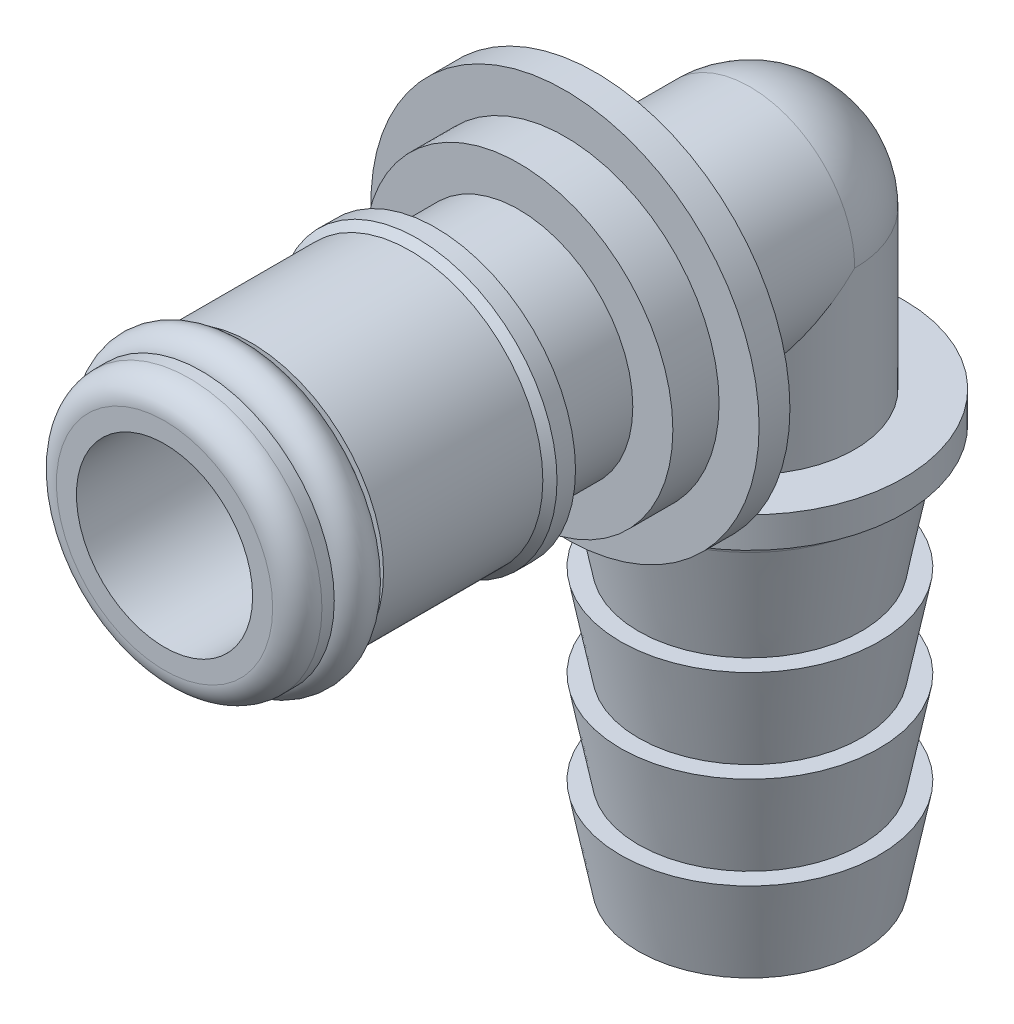
ISO-10303-21;
HEADER;
FILE_DESCRIPTION(('STEP AP214'),'2;1');
FILE_NAME('part.step','',(''),(''),'','','');
FILE_SCHEMA(('AUTOMOTIVE_DESIGN { 1 0 10303 214 1 1 1 1 }'));
ENDSEC;
DATA;
#1=APPLICATION_CONTEXT('core data for automotive mechanical design processes');
#2=APPLICATION_PROTOCOL_DEFINITION('international standard','automotive_design',2000,#1);
#3=PRODUCT_CONTEXT('',#1,'mechanical');
#4=PRODUCT('Part','Part','',(#3));
#5=PRODUCT_RELATED_PRODUCT_CATEGORY('part','',(#4));
#6=PRODUCT_DEFINITION_FORMATION('','',#4);
#7=PRODUCT_DEFINITION_CONTEXT('part definition',#1,'design');
#8=PRODUCT_DEFINITION('design','',#6,#7);
#9=PRODUCT_DEFINITION_SHAPE('','',#8);
#10=(LENGTH_UNIT() NAMED_UNIT(*) SI_UNIT(.MILLI.,.METRE.));
#11=(NAMED_UNIT(*) PLANE_ANGLE_UNIT() SI_UNIT($,.RADIAN.));
#12=(NAMED_UNIT(*) SI_UNIT($,.STERADIAN.) SOLID_ANGLE_UNIT());
#13=UNCERTAINTY_MEASURE_WITH_UNIT(LENGTH_MEASURE(1.E-05),#10,'distance_accuracy_value','');
#14=(GEOMETRIC_REPRESENTATION_CONTEXT(3) GLOBAL_UNCERTAINTY_ASSIGNED_CONTEXT((#13)) GLOBAL_UNIT_ASSIGNED_CONTEXT((#10,
#11,#12)) REPRESENTATION_CONTEXT('',''));
#15=CARTESIAN_POINT('',(0.,0.,0.));
#16=DIRECTION('',(0.,0.,1.));
#17=DIRECTION('',(1.,0.,0.));
#18=AXIS2_PLACEMENT_3D('',#15,#16,#17);
#19=CARTESIAN_POINT('',(0.,7.1755,-16.51));
#20=DIRECTION('',(0.,0.,1.));
#21=DIRECTION('',(1.,0.,0.));
#22=AXIS2_PLACEMENT_3D('',#19,#20,#21);
#23=PLANE('',#22);
#24=CARTESIAN_POINT('',(0.,0.,-16.51));
#25=DIRECTION('',(0.,0.,1.));
#26=DIRECTION('',(1.,0.,0.));
#27=AXIS2_PLACEMENT_3D('',#24,#25,#26);
#28=CIRCLE('',#27,8.001);
#29=CARTESIAN_POINT('',(8.001,0.,-16.51));
#30=VERTEX_POINT('',#29);
#31=EDGE_CURVE('E115',#30,#30,#28,.F.);
#32=ORIENTED_EDGE('',*,*,#31,.F.);
#33=EDGE_LOOP('',(#32));
#34=FACE_BOUND('',#33,.T.);
#35=CARTESIAN_POINT('',(0.,0.,-16.51));
#36=DIRECTION('',(0.,0.,1.));
#37=DIRECTION('',(1.,0.,0.));
#38=AXIS2_PLACEMENT_3D('',#35,#36,#37);
#39=CIRCLE('',#38,6.35);
#40=CARTESIAN_POINT('',(6.35,0.,-16.51));
#41=VERTEX_POINT('',#40);
#42=EDGE_CURVE('E20',#41,#41,#39,.T.);
#43=ORIENTED_EDGE('',*,*,#42,.F.);
#44=EDGE_LOOP('',(#43));
#45=FACE_BOUND('',#44,.T.);
#46=ADVANCED_FACE('F17',(#34,#45),#23,.T.);
#47=CARTESIAN_POINT('',(0.,0.,-15.5575));
#48=DIRECTION('',(0.,0.,1.));
#49=DIRECTION('',(1.,0.,0.));
#50=AXIS2_PLACEMENT_3D('',#47,#48,#49);
#51=CYLINDRICAL_SURFACE('',#50,6.35);
#52=CARTESIAN_POINT('',(0.,0.,-14.605));
#53=DIRECTION('',(0.,0.,1.));
#54=DIRECTION('',(1.,0.,0.));
#55=AXIS2_PLACEMENT_3D('',#52,#53,#54);
#56=CIRCLE('',#55,6.35);
#57=CARTESIAN_POINT('',(6.35,0.,-14.605));
#58=VERTEX_POINT('',#57);
#59=EDGE_CURVE('E92',#58,#58,#56,.T.);
#60=ORIENTED_EDGE('',*,*,#59,.F.);
#61=EDGE_LOOP('',(#60));
#62=FACE_BOUND('',#61,.T.);
#63=ORIENTED_EDGE('',*,*,#42,.T.);
#64=EDGE_LOOP('',(#63));
#65=FACE_BOUND('',#64,.T.);
#66=ADVANCED_FACE('F122',(#62,#65),#51,.T.);
#67=CARTESIAN_POINT('',(0.,0.,-17.145));
#68=DIRECTION('',(0.,0.,1.));
#69=DIRECTION('',(1.,0.,0.));
#70=AXIS2_PLACEMENT_3D('',#67,#68,#69);
#71=CYLINDRICAL_SURFACE('',#70,8.001);
#72=ORIENTED_EDGE('',*,*,#31,.T.);
#73=EDGE_LOOP('',(#72));
#74=FACE_BOUND('',#73,.T.);
#75=CARTESIAN_POINT('',(0.,0.,-17.78));
#76=DIRECTION('',(0.,0.,1.));
#77=DIRECTION('',(1.,0.,0.));
#78=AXIS2_PLACEMENT_3D('',#75,#76,#77);
#79=CIRCLE('',#78,8.001);
#80=CARTESIAN_POINT('',(8.001,0.,-17.78));
#81=VERTEX_POINT('',#80);
#82=EDGE_CURVE('E109',#81,#81,#79,.F.);
#83=ORIENTED_EDGE('',*,*,#82,.F.);
#84=EDGE_LOOP('',(#83));
#85=FACE_BOUND('',#84,.T.);
#86=ADVANCED_FACE('F130',(#74,#85),#71,.T.);
#87=CARTESIAN_POINT('',(0.,5.5245,-14.605));
#88=DIRECTION('',(0.,0.,1.));
#89=DIRECTION('',(1.,0.,0.));
#90=AXIS2_PLACEMENT_3D('',#87,#88,#89);
#91=PLANE('',#90);
#92=ORIENTED_EDGE('',*,*,#59,.T.);
#93=EDGE_LOOP('',(#92));
#94=FACE_BOUND('',#93,.T.);
#95=CARTESIAN_POINT('',(0.,0.,-14.605));
#96=DIRECTION('',(0.,0.,1.));
#97=DIRECTION('',(1.,0.,0.));
#98=AXIS2_PLACEMENT_3D('',#95,#96,#97);
#99=CIRCLE('',#98,4.699);
#100=CARTESIAN_POINT('',(4.699,0.,-14.605));
#101=VERTEX_POINT('',#100);
#102=EDGE_CURVE('E105',#101,#101,#99,.T.);
#103=ORIENTED_EDGE('',*,*,#102,.F.);
#104=EDGE_LOOP('',(#103));
#105=FACE_BOUND('',#104,.T.);
#106=ADVANCED_FACE('F300',(#94,#105),#91,.T.);
#107=CARTESIAN_POINT('',(0.,0.,-24.13));
#108=DIRECTION('',(0.802040309353768,0.400914120791459,0.442717980120217));
#109=DIRECTION('',(-0.355518452684288,0.916075178156479,-0.185507136699764));
#110=AXIS2_PLACEMENT_3D('',#107,#108,#109);
#111=SPHERICAL_SURFACE('',#110,4.31800000000001);
#112=CARTESIAN_POINT('',(0.,0.,-24.13));
#113=DIRECTION('',(0.,0.,1.));
#114=DIRECTION('',(1.,0.,0.));
#115=AXIS2_PLACEMENT_3D('',#112,#113,#114);
#116=CIRCLE('',#115,4.318);
#117=CARTESIAN_POINT('',(4.318,0.,-24.13));
#118=VERTEX_POINT('',#117);
#119=CARTESIAN_POINT('',(-4.318,0.,-24.13));
#120=VERTEX_POINT('',#119);
#121=EDGE_CURVE('E81',#118,#120,#116,.T.);
#122=ORIENTED_EDGE('',*,*,#121,.F.);
#123=CARTESIAN_POINT('',(0.,0.,-24.13));
#124=DIRECTION('',(0.,1.,0.));
#125=DIRECTION('',(0.,0.,1.));
#126=AXIS2_PLACEMENT_3D('',#123,#124,#125);
#127=CIRCLE('',#126,4.318);
#128=EDGE_CURVE('E76',#120,#118,#127,.F.);
#129=ORIENTED_EDGE('',*,*,#128,.F.);
#130=EDGE_LOOP('',(#122,#129));
#131=FACE_BOUND('',#130,.T.);
#132=ADVANCED_FACE('F80',(#131),#111,.T.);
#133=CARTESIAN_POINT('',(0.,0.,-20.955));
#134=DIRECTION('',(0.,0.,1.));
#135=DIRECTION('',(1.,0.,0.));
#136=AXIS2_PLACEMENT_3D('',#133,#134,#135);
#137=CYLINDRICAL_SURFACE('',#136,4.318);
#138=CARTESIAN_POINT('',(0.,0.,-24.13));
#139=DIRECTION('',(0.,0.707106781186547,0.707106781186547));
#140=DIRECTION('',(0.,0.707106781186547,-0.707106781186547));
#141=AXIS2_PLACEMENT_3D('',#138,#139,#140);
#142=ELLIPSE('',#141,6.10657416232702,4.318);
#143=CARTESIAN_POINT('',(0.635,-4.27105361708326,-19.8589463829167));
#144=VERTEX_POINT('',#143);
#145=EDGE_CURVE('E83',#118,#144,#142,.F.);
#146=ORIENTED_EDGE('',*,*,#145,.F.);
#147=ORIENTED_EDGE('',*,*,#121,.T.);
#148=CARTESIAN_POINT('',(0.,0.,-24.13));
#149=DIRECTION('',(0.,0.707106781186547,0.707106781186547));
#150=DIRECTION('',(0.,-0.707106781186547,0.707106781186547));
#151=AXIS2_PLACEMENT_3D('',#148,#149,#150);
#152=ELLIPSE('',#151,6.10657416232702,4.318);
#153=CARTESIAN_POINT('',(-0.635000000000002,-4.27105361708326,-19.8589463829167));
#154=VERTEX_POINT('',#153);
#155=EDGE_CURVE('E84',#154,#120,#152,.F.);
#156=ORIENTED_EDGE('',*,*,#155,.F.);
#157=DIRECTION('',(0.,0.,-1.));
#158=VECTOR('',#157,1.);
#159=CARTESIAN_POINT('',(-0.635,-4.27105361708326,0.));
#160=LINE('',#159,#158);
#161=CARTESIAN_POINT('',(-0.635,-4.27105361708326,-17.78));
#162=VERTEX_POINT('',#161);
#163=EDGE_CURVE('E108',#154,#162,#160,.F.);
#164=ORIENTED_EDGE('',*,*,#163,.T.);
#165=CARTESIAN_POINT('',(0.,0.,-17.78));
#166=DIRECTION('',(0.,0.,1.));
#167=DIRECTION('',(1.,0.,0.));
#168=AXIS2_PLACEMENT_3D('',#165,#166,#167);
#169=CIRCLE('',#168,4.318);
#170=CARTESIAN_POINT('',(0.635,-4.27105361708326,-17.78));
#171=VERTEX_POINT('',#170);
#172=EDGE_CURVE('E91',#171,#162,#169,.T.);
#173=ORIENTED_EDGE('',*,*,#172,.F.);
#174=DIRECTION('',(0.,0.,-1.));
#175=VECTOR('',#174,1.);
#176=CARTESIAN_POINT('',(0.635,-4.27105361708326,0.));
#177=LINE('',#176,#175);
#178=EDGE_CURVE('E325',#144,#171,#177,.F.);
#179=ORIENTED_EDGE('',*,*,#178,.F.);
#180=EDGE_LOOP('',(#146,#147,#156,#164,#173,#179));
#181=FACE_BOUND('',#180,.T.);
#182=ADVANCED_FACE('F88',(#181),#137,.T.);
#183=CARTESIAN_POINT('',(0.,6.1595,-17.78));
#184=DIRECTION('',(0.,0.,-1.));
#185=DIRECTION('',(-1.,0.,0.));
#186=AXIS2_PLACEMENT_3D('',#183,#184,#185);
#187=PLANE('',#186);
#188=ORIENTED_EDGE('',*,*,#82,.T.);
#189=EDGE_LOOP('',(#188));
#190=FACE_BOUND('',#189,.T.);
#191=DIRECTION('',(0.,1.,0.));
#192=VECTOR('',#191,1.);
#193=CARTESIAN_POINT('',(-0.635,0.,-17.78));
#194=LINE('',#193,#192);
#195=CARTESIAN_POINT('',(-0.635,-7.747,-17.78));
#196=VERTEX_POINT('',#195);
#197=EDGE_CURVE('E307',#162,#196,#194,.F.);
#198=ORIENTED_EDGE('',*,*,#197,.T.);
#199=DIRECTION('',(-1.,0.,0.));
#200=VECTOR('',#199,1.);
#201=CARTESIAN_POINT('',(0.,-7.747,-17.78));
#202=LINE('',#201,#200);
#203=CARTESIAN_POINT('',(0.635,-7.747,-17.78));
#204=VERTEX_POINT('',#203);
#205=EDGE_CURVE('E112',#196,#204,#202,.F.);
#206=ORIENTED_EDGE('',*,*,#205,.T.);
#207=DIRECTION('',(0.,1.,0.));
#208=VECTOR('',#207,1.);
#209=CARTESIAN_POINT('',(0.635,0.,-17.78));
#210=LINE('',#209,#208);
#211=EDGE_CURVE('E327',#171,#204,#210,.F.);
#212=ORIENTED_EDGE('',*,*,#211,.F.);
#213=ORIENTED_EDGE('',*,*,#172,.T.);
#214=EDGE_LOOP('',(#198,#206,#212,#213));
#215=FACE_BOUND('',#214,.T.);
#216=ADVANCED_FACE('F290',(#190,#215),#187,.T.);
#217=CARTESIAN_POINT('',(0.,0.,-12.8905));
#218=DIRECTION('',(0.,0.,1.));
#219=DIRECTION('',(1.,0.,0.));
#220=AXIS2_PLACEMENT_3D('',#217,#218,#219);
#221=CYLINDRICAL_SURFACE('',#220,4.699);
#222=CARTESIAN_POINT('',(0.,0.,-11.176));
#223=DIRECTION('',(0.,0.,1.));
#224=DIRECTION('',(1.,0.,0.));
#225=AXIS2_PLACEMENT_3D('',#222,#223,#224);
#226=CIRCLE('',#225,4.699);
#227=CARTESIAN_POINT('',(4.699,0.,-11.176));
#228=VERTEX_POINT('',#227);
#229=EDGE_CURVE('E334',#228,#228,#226,.T.);
#230=ORIENTED_EDGE('',*,*,#229,.F.);
#231=EDGE_LOOP('',(#230));
#232=FACE_BOUND('',#231,.T.);
#233=ORIENTED_EDGE('',*,*,#102,.T.);
#234=EDGE_LOOP('',(#233));
#235=FACE_BOUND('',#234,.T.);
#236=ADVANCED_FACE('F286',(#232,#235),#221,.T.);
#237=CARTESIAN_POINT('',(-0.635,0.,0.));
#238=DIRECTION('',(1.,0.,0.));
#239=DIRECTION('',(0.,0.,-1.));
#240=AXIS2_PLACEMENT_3D('',#237,#238,#239);
#241=PLANE('',#240);
#242=DIRECTION('',(0.,0.,1.));
#243=VECTOR('',#242,1.);
#244=CARTESIAN_POINT('',(-0.635,-6.477,-29.464));
#245=LINE('',#244,#243);
#246=CARTESIAN_POINT('',(-0.635,-6.477,-17.811829774373));
#247=VERTEX_POINT('',#246);
#248=CARTESIAN_POINT('',(-0.635000000000002,-6.477,-19.8589463829167));
#249=VERTEX_POINT('',#248);
#250=EDGE_CURVE('E337',#247,#249,#245,.F.);
#251=ORIENTED_EDGE('',*,*,#250,.F.);
#252=DIRECTION('',(0.,1.,0.));
#253=VECTOR('',#252,1.);
#254=CARTESIAN_POINT('',(-0.635,0.,-17.811829774373));
#255=LINE('',#254,#253);
#256=CARTESIAN_POINT('',(-0.635,-7.747,-17.811829774373));
#257=VERTEX_POINT('',#256);
#258=EDGE_CURVE('E99',#257,#247,#255,.T.);
#259=ORIENTED_EDGE('',*,*,#258,.F.);
#260=DIRECTION('',(0.,0.,-1.));
#261=VECTOR('',#260,1.);
#262=CARTESIAN_POINT('',(-0.635,-7.747,0.));
#263=LINE('',#262,#261);
#264=EDGE_CURVE('E101',#196,#257,#263,.T.);
#265=ORIENTED_EDGE('',*,*,#264,.F.);
#266=ORIENTED_EDGE('',*,*,#197,.F.);
#267=ORIENTED_EDGE('',*,*,#163,.F.);
#268=DIRECTION('',(0.,1.,0.));
#269=VECTOR('',#268,1.);
#270=CARTESIAN_POINT('',(-0.635000000000003,-3.2385,-19.8589463829167));
#271=LINE('',#270,#269);
#272=EDGE_CURVE('E98',#249,#154,#271,.T.);
#273=ORIENTED_EDGE('',*,*,#272,.F.);
#274=EDGE_LOOP('',(#251,#259,#265,#266,#267,#273));
#275=FACE_BOUND('',#274,.T.);
#276=ADVANCED_FACE('F283',(#275),#241,.F.);
#277=CARTESIAN_POINT('',(0.,-3.2385,-24.13));
#278=DIRECTION('',(0.,1.,0.));
#279=DIRECTION('',(0.,0.,1.));
#280=AXIS2_PLACEMENT_3D('',#277,#278,#279);
#281=CYLINDRICAL_SURFACE('',#280,4.318);
#282=CARTESIAN_POINT('',(0.,-6.477,-24.13));
#283=DIRECTION('',(0.,1.,0.));
#284=DIRECTION('',(0.,0.,1.));
#285=AXIS2_PLACEMENT_3D('',#282,#283,#284);
#286=CIRCLE('',#285,4.318);
#287=CARTESIAN_POINT('',(0.635,-6.477,-19.8589463829167));
#288=VERTEX_POINT('',#287);
#289=EDGE_CURVE('E339',#249,#288,#286,.F.);
#290=ORIENTED_EDGE('',*,*,#289,.F.);
#291=ORIENTED_EDGE('',*,*,#272,.T.);
#292=ORIENTED_EDGE('',*,*,#155,.T.);
#293=ORIENTED_EDGE('',*,*,#128,.T.);
#294=ORIENTED_EDGE('',*,*,#145,.T.);
#295=DIRECTION('',(0.,1.,0.));
#296=VECTOR('',#295,1.);
#297=CARTESIAN_POINT('',(0.635,0.,-19.8589463829167));
#298=LINE('',#297,#296);
#299=EDGE_CURVE('E328',#288,#144,#298,.T.);
#300=ORIENTED_EDGE('',*,*,#299,.F.);
#301=EDGE_LOOP('',(#290,#291,#292,#293,#294,#300));
#302=FACE_BOUND('',#301,.T.);
#303=ADVANCED_FACE('F96',(#302),#281,.T.);
#304=CARTESIAN_POINT('',(0.635,0.,0.));
#305=DIRECTION('',(1.,0.,0.));
#306=DIRECTION('',(0.,0.,-1.));
#307=AXIS2_PLACEMENT_3D('',#304,#305,#306);
#308=PLANE('',#307);
#309=DIRECTION('',(0.,1.,0.));
#310=VECTOR('',#309,1.);
#311=CARTESIAN_POINT('',(0.635,0.,-17.811829774373));
#312=LINE('',#311,#310);
#313=CARTESIAN_POINT('',(0.635,-7.747,-17.811829774373));
#314=VERTEX_POINT('',#313);
#315=CARTESIAN_POINT('',(0.635,-6.477,-17.811829774373));
#316=VERTEX_POINT('',#315);
#317=EDGE_CURVE('E330',#314,#316,#312,.T.);
#318=ORIENTED_EDGE('',*,*,#317,.T.);
#319=DIRECTION('',(0.,0.,1.));
#320=VECTOR('',#319,1.);
#321=CARTESIAN_POINT('',(0.635,-6.477,-29.464));
#322=LINE('',#321,#320);
#323=EDGE_CURVE('E340',#288,#316,#322,.T.);
#324=ORIENTED_EDGE('',*,*,#323,.F.);
#325=ORIENTED_EDGE('',*,*,#299,.T.);
#326=ORIENTED_EDGE('',*,*,#178,.T.);
#327=ORIENTED_EDGE('',*,*,#211,.T.);
#328=DIRECTION('',(0.,0.,-1.));
#329=VECTOR('',#328,1.);
#330=CARTESIAN_POINT('',(0.635,-7.747,0.));
#331=LINE('',#330,#329);
#332=EDGE_CURVE('E322',#204,#314,#331,.T.);
#333=ORIENTED_EDGE('',*,*,#332,.T.);
#334=EDGE_LOOP('',(#318,#324,#325,#326,#327,#333));
#335=FACE_BOUND('',#334,.T.);
#336=ADVANCED_FACE('F276',(#335),#308,.T.);
#337=CARTESIAN_POINT('',(0.,5.2324,-11.176));
#338=DIRECTION('',(0.,0.,-1.));
#339=DIRECTION('',(-1.,0.,0.));
#340=AXIS2_PLACEMENT_3D('',#337,#338,#339);
#341=PLANE('',#340);
#342=ORIENTED_EDGE('',*,*,#229,.T.);
#343=EDGE_LOOP('',(#342));
#344=FACE_BOUND('',#343,.T.);
#345=CARTESIAN_POINT('',(0.,0.,-11.176));
#346=DIRECTION('',(0.,0.,1.));
#347=DIRECTION('',(1.,0.,0.));
#348=AXIS2_PLACEMENT_3D('',#345,#346,#347);
#349=CIRCLE('',#348,5.7658);
#350=CARTESIAN_POINT('',(5.7658,0.,-11.176));
#351=VERTEX_POINT('',#350);
#352=EDGE_CURVE('E343',#351,#351,#349,.T.);
#353=ORIENTED_EDGE('',*,*,#352,.F.);
#354=EDGE_LOOP('',(#353));
#355=FACE_BOUND('',#354,.T.);
#356=ADVANCED_FACE('F272',(#344,#355),#341,.T.);
#357=CARTESIAN_POINT('',(0.,-6.477,-29.464));
#358=DIRECTION('',(0.,1.,0.));
#359=DIRECTION('',(0.,0.,1.));
#360=AXIS2_PLACEMENT_3D('',#357,#358,#359);
#361=PLANE('',#360);
#362=ORIENTED_EDGE('',*,*,#323,.T.);
#363=CARTESIAN_POINT('',(0.,-6.477,-24.13));
#364=DIRECTION('',(0.,1.,0.));
#365=DIRECTION('',(0.,0.,1.));
#366=AXIS2_PLACEMENT_3D('',#363,#364,#365);
#367=CIRCLE('',#366,6.35);
#368=EDGE_CURVE('E347',#247,#316,#367,.F.);
#369=ORIENTED_EDGE('',*,*,#368,.F.);
#370=ORIENTED_EDGE('',*,*,#250,.T.);
#371=ORIENTED_EDGE('',*,*,#289,.T.);
#372=EDGE_LOOP('',(#362,#369,#370,#371));
#373=FACE_BOUND('',#372,.T.);
#374=ADVANCED_FACE('F268',(#373),#361,.T.);
#375=CARTESIAN_POINT('',(0.,0.,-10.795));
#376=DIRECTION('',(0.,0.,1.));
#377=DIRECTION('',(1.,0.,0.));
#378=AXIS2_PLACEMENT_3D('',#375,#376,#377);
#379=CYLINDRICAL_SURFACE('',#378,5.7658);
#380=CARTESIAN_POINT('',(0.,0.,-10.4139999999688));
#381=DIRECTION('',(0.,0.,-1.));
#382=DIRECTION('',(0.,1.,0.));
#383=AXIS2_PLACEMENT_3D('',#380,#381,#382);
#384=CIRCLE('',#383,5.76580000000604);
#385=CARTESIAN_POINT('',(0.,5.76580000000604,-10.4139999999688));
#386=VERTEX_POINT('',#385);
#387=EDGE_CURVE('E344',#386,#386,#384,.F.);
#388=ORIENTED_EDGE('',*,*,#387,.F.);
#389=EDGE_LOOP('',(#388));
#390=FACE_BOUND('',#389,.T.);
#391=ORIENTED_EDGE('',*,*,#352,.T.);
#392=EDGE_LOOP('',(#391));
#393=FACE_BOUND('',#392,.T.);
#394=ADVANCED_FACE('F264',(#390,#393),#379,.T.);
#395=CARTESIAN_POINT('',(0.,-7.112,-24.13));
#396=DIRECTION('',(0.,1.,0.));
#397=DIRECTION('',(0.,0.,1.));
#398=AXIS2_PLACEMENT_3D('',#395,#396,#397);
#399=CYLINDRICAL_SURFACE('',#398,6.35);
#400=ORIENTED_EDGE('',*,*,#317,.F.);
#401=CARTESIAN_POINT('',(0.,-7.747,-24.13));
#402=DIRECTION('',(0.,1.,0.));
#403=DIRECTION('',(0.,0.,1.));
#404=AXIS2_PLACEMENT_3D('',#401,#402,#403);
#405=CIRCLE('',#404,6.35);
#406=EDGE_CURVE('E320',#257,#314,#405,.F.);
#407=ORIENTED_EDGE('',*,*,#406,.F.);
#408=ORIENTED_EDGE('',*,*,#258,.T.);
#409=ORIENTED_EDGE('',*,*,#368,.T.);
#410=EDGE_LOOP('',(#400,#407,#408,#409));
#411=FACE_BOUND('',#410,.T.);
#412=ADVANCED_FACE('F260',(#411),#399,.T.);
#413=CARTESIAN_POINT('',(0.,0.,-10.4139999999688));
#414=DIRECTION('',(0.,0.,-1.));
#415=DIRECTION('',(-1.,0.,0.));
#416=AXIS2_PLACEMENT_3D('',#413,#414,#415);
#417=CONICAL_SURFACE('',#416,5.76580000000604,0.785398163397448);
#418=CARTESIAN_POINT('',(0.,0.,-10.1219));
#419=DIRECTION('',(0.,0.,1.));
#420=DIRECTION('',(1.,0.,0.));
#421=AXIS2_PLACEMENT_3D('',#418,#419,#420);
#422=CIRCLE('',#421,5.4737);
#423=CARTESIAN_POINT('',(5.4737,0.,-10.1219));
#424=VERTEX_POINT('',#423);
#425=EDGE_CURVE('E348',#424,#424,#422,.T.);
#426=ORIENTED_EDGE('',*,*,#425,.F.);
#427=EDGE_LOOP('',(#426));
#428=FACE_BOUND('',#427,.T.);
#429=ORIENTED_EDGE('',*,*,#387,.T.);
#430=EDGE_LOOP('',(#429));
#431=FACE_BOUND('',#430,.T.);
#432=ADVANCED_FACE('F256',(#428,#431),#417,.T.);
#433=CARTESIAN_POINT('',(0.635,-7.747,-17.78));
#434=DIRECTION('',(0.,-1.,0.));
#435=DIRECTION('',(0.,0.,-1.));
#436=AXIS2_PLACEMENT_3D('',#433,#434,#435);
#437=PLANE('',#436);
#438=ORIENTED_EDGE('',*,*,#205,.F.);
#439=ORIENTED_EDGE('',*,*,#264,.T.);
#440=ORIENTED_EDGE('',*,*,#406,.T.);
#441=ORIENTED_EDGE('',*,*,#332,.F.);
#442=EDGE_LOOP('',(#438,#439,#440,#441));
#443=FACE_BOUND('',#442,.T.);
#444=CARTESIAN_POINT('',(0.,-7.747,-24.13));
#445=DIRECTION('',(0.,-1.,0.));
#446=DIRECTION('',(0.,0.,-1.));
#447=AXIS2_PLACEMENT_3D('',#444,#445,#446);
#448=CIRCLE('',#447,6.31369803959666);
#449=CARTESIAN_POINT('',(0.,-7.747,-30.4436980395967));
#450=VERTEX_POINT('',#449);
#451=EDGE_CURVE('E243',#450,#450,#448,.T.);
#452=ORIENTED_EDGE('',*,*,#451,.F.);
#453=EDGE_LOOP('',(#452));
#454=FACE_BOUND('',#453,.T.);
#455=ADVANCED_FACE('F247',(#443,#454),#437,.T.);
#456=CARTESIAN_POINT('',(0.,0.,-6.83895));
#457=DIRECTION('',(0.,0.,1.));
#458=DIRECTION('',(1.,0.,0.));
#459=AXIS2_PLACEMENT_3D('',#456,#457,#458);
#460=CYLINDRICAL_SURFACE('',#459,5.4737);
#461=CARTESIAN_POINT('',(0.,0.,-3.556));
#462=DIRECTION('',(0.,0.,1.));
#463=DIRECTION('',(1.,0.,0.));
#464=AXIS2_PLACEMENT_3D('',#461,#462,#463);
#465=CIRCLE('',#464,5.4737);
#466=CARTESIAN_POINT('',(5.4737,0.,-3.556));
#467=VERTEX_POINT('',#466);
#468=EDGE_CURVE('E359',#467,#467,#465,.T.);
#469=ORIENTED_EDGE('',*,*,#468,.F.);
#470=EDGE_LOOP('',(#469));
#471=FACE_BOUND('',#470,.T.);
#472=ORIENTED_EDGE('',*,*,#425,.T.);
#473=EDGE_LOOP('',(#472));
#474=FACE_BOUND('',#473,.T.);
#475=ADVANCED_FACE('F233',(#471,#474),#460,.T.);
#476=CARTESIAN_POINT('',(0.,-8.636,-24.13));
#477=DIRECTION('',(0.,1.,0.));
#478=DIRECTION('',(0.,0.,1.));
#479=AXIS2_PLACEMENT_3D('',#476,#477,#478);
#480=TOROIDAL_SURFACE('',#479,6.31369803959666,0.889000000000002);
#481=CARTESIAN_POINT('',(0.,-8.46637080309165,-24.13));
#482=DIRECTION('',(0.,1.,0.));
#483=DIRECTION('',(0.,0.,-1.));
#484=AXIS2_PLACEMENT_3D('',#481,#482,#483);
#485=CIRCLE('',#484,5.44103147350893);
#486=CARTESIAN_POINT('',(0.,-8.46637080309165,-29.5710314735089));
#487=VERTEX_POINT('',#486);
#488=EDGE_CURVE('E195',#487,#487,#485,.F.);
#489=ORIENTED_EDGE('',*,*,#488,.F.);
#490=EDGE_LOOP('',(#489));
#491=FACE_BOUND('',#490,.T.);
#492=ORIENTED_EDGE('',*,*,#451,.T.);
#493=EDGE_LOOP('',(#492));
#494=FACE_BOUND('',#493,.T.);
#495=ADVANCED_FACE('F228',(#491,#494),#480,.F.);
#496=CARTESIAN_POINT('',(0.,4.8133,-3.556));
#497=DIRECTION('',(0.,0.,1.));
#498=DIRECTION('',(1.,0.,0.));
#499=AXIS2_PLACEMENT_3D('',#496,#497,#498);
#500=PLANE('',#499);
#501=ORIENTED_EDGE('',*,*,#468,.T.);
#502=EDGE_LOOP('',(#501));
#503=FACE_BOUND('',#502,.T.);
#504=CARTESIAN_POINT('',(0.,0.,-3.556));
#505=DIRECTION('',(0.,0.,1.));
#506=DIRECTION('',(1.,0.,0.));
#507=AXIS2_PLACEMENT_3D('',#504,#505,#506);
#508=CIRCLE('',#507,4.1529);
#509=CARTESIAN_POINT('',(4.1529,0.,-3.556));
#510=VERTEX_POINT('',#509);
#511=EDGE_CURVE('E627',#510,#510,#508,.T.);
#512=ORIENTED_EDGE('',*,*,#511,.F.);
#513=EDGE_LOOP('',(#512));
#514=FACE_BOUND('',#513,.T.);
#515=ADVANCED_FACE('F224',(#503,#514),#500,.T.);
#516=CARTESIAN_POINT('',(0.,-8.46637080309165,-24.13));
#517=DIRECTION('',(0.,1.,0.));
#518=DIRECTION('',(0.,0.,1.));
#519=AXIS2_PLACEMENT_3D('',#516,#517,#518);
#520=CONICAL_SURFACE('',#519,5.44103147350893,0.191986217720595);
#521=ORIENTED_EDGE('',*,*,#488,.T.);
#522=EDGE_LOOP('',(#521));
#523=FACE_BOUND('',#522,.T.);
#524=CARTESIAN_POINT('',(0.,-12.8270000000157,-24.13));
#525=DIRECTION('',(0.,1.,0.));
#526=DIRECTION('',(0.,0.,1.));
#527=AXIS2_PLACEMENT_3D('',#524,#525,#526);
#528=CIRCLE('',#527,4.59341102217035);
#529=CARTESIAN_POINT('',(0.,-12.8270000000157,-19.5365889778296));
#530=VERTEX_POINT('',#529);
#531=EDGE_CURVE('E625',#530,#530,#528,.F.);
#532=ORIENTED_EDGE('',*,*,#531,.F.);
#533=EDGE_LOOP('',(#532));
#534=FACE_BOUND('',#533,.T.);
#535=ADVANCED_FACE('F220',(#523,#534),#520,.T.);
#536=CARTESIAN_POINT('',(0.,0.,-3.0988));
#537=DIRECTION('',(0.,0.,1.));
#538=DIRECTION('',(1.,0.,0.));
#539=AXIS2_PLACEMENT_3D('',#536,#537,#538);
#540=CYLINDRICAL_SURFACE('',#539,4.1529);
#541=CARTESIAN_POINT('',(0.,0.,-2.6416));
#542=DIRECTION('',(0.,0.,1.));
#543=DIRECTION('',(1.,0.,0.));
#544=AXIS2_PLACEMENT_3D('',#541,#542,#543);
#545=CIRCLE('',#544,4.1529);
#546=CARTESIAN_POINT('',(4.1529,0.,-2.6416));
#547=VERTEX_POINT('',#546);
#548=EDGE_CURVE('E622',#547,#547,#545,.T.);
#549=ORIENTED_EDGE('',*,*,#548,.F.);
#550=EDGE_LOOP('',(#549));
#551=FACE_BOUND('',#550,.T.);
#552=ORIENTED_EDGE('',*,*,#511,.T.);
#553=EDGE_LOOP('',(#552));
#554=FACE_BOUND('',#553,.T.);
#555=ADVANCED_FACE('F216',(#551,#554),#540,.T.);
#556=CARTESIAN_POINT('',(0.,-12.827,-29.0937055110926));
#557=DIRECTION('',(0.,1.,0.));
#558=DIRECTION('',(0.,0.,1.));
#559=AXIS2_PLACEMENT_3D('',#556,#557,#558);
#560=PLANE('',#559);
#561=CARTESIAN_POINT('',(0.,-12.8270000000157,-24.13));
#562=DIRECTION('',(0.,1.,0.));
#563=DIRECTION('',(0.,0.,1.));
#564=AXIS2_PLACEMENT_3D('',#561,#562,#563);
#565=CIRCLE('',#564,5.33399999999017);
#566=CARTESIAN_POINT('',(0.,-12.8270000000157,-18.7960000000098));
#567=VERTEX_POINT('',#566);
#568=EDGE_CURVE('E619',#567,#567,#565,.F.);
#569=ORIENTED_EDGE('',*,*,#568,.F.);
#570=EDGE_LOOP('',(#569));
#571=FACE_BOUND('',#570,.T.);
#572=ORIENTED_EDGE('',*,*,#531,.T.);
#573=EDGE_LOOP('',(#572));
#574=FACE_BOUND('',#573,.T.);
#575=ADVANCED_FACE('F212',(#571,#574),#560,.T.);
#576=CARTESIAN_POINT('',(0.,4.37388,-2.6416));
#577=DIRECTION('',(0.,0.,-1.));
#578=DIRECTION('',(-1.,0.,0.));
#579=AXIS2_PLACEMENT_3D('',#576,#577,#578);
#580=PLANE('',#579);
#581=ORIENTED_EDGE('',*,*,#548,.T.);
#582=EDGE_LOOP('',(#581));
#583=FACE_BOUND('',#582,.T.);
#584=CARTESIAN_POINT('',(0.,0.,-2.6416));
#585=DIRECTION('',(0.,0.,1.));
#586=DIRECTION('',(1.,0.,0.));
#587=AXIS2_PLACEMENT_3D('',#584,#585,#586);
#588=CIRCLE('',#587,4.22222479654374);
#589=CARTESIAN_POINT('',(4.22222479654374,0.,-2.6416));
#590=VERTEX_POINT('',#589);
#591=EDGE_CURVE('E616',#590,#590,#588,.T.);
#592=ORIENTED_EDGE('',*,*,#591,.F.);
#593=EDGE_LOOP('',(#592));
#594=FACE_BOUND('',#593,.T.);
#595=ADVANCED_FACE('F208',(#583,#594),#580,.T.);
#596=CARTESIAN_POINT('',(0.,-12.8270000000157,-24.13));
#597=DIRECTION('',(0.,1.,0.));
#598=DIRECTION('',(0.,0.,1.));
#599=AXIS2_PLACEMENT_3D('',#596,#597,#598);
#600=CONICAL_SURFACE('',#599,5.33399999999017,0.191986217721296);
#601=ORIENTED_EDGE('',*,*,#568,.T.);
#602=EDGE_LOOP('',(#601));
#603=FACE_BOUND('',#602,.T.);
#604=CARTESIAN_POINT('',(0.,-16.6370000000029,-24.13));
#605=DIRECTION('',(0.,1.,0.));
#606=DIRECTION('',(0.,0.,1.));
#607=AXIS2_PLACEMENT_3D('',#604,#605,#606);
#608=CIRCLE('',#607,4.59341102217035);
#609=CARTESIAN_POINT('',(0.,-16.6370000000029,-19.5365889778296));
#610=VERTEX_POINT('',#609);
#611=EDGE_CURVE('E613',#610,#610,#608,.F.);
#612=ORIENTED_EDGE('',*,*,#611,.F.);
#613=EDGE_LOOP('',(#612));
#614=FACE_BOUND('',#613,.T.);
#615=ADVANCED_FACE('F203',(#603,#614),#600,.T.);
#616=CARTESIAN_POINT('',(0.,0.,-2.54));
#617=DIRECTION('',(0.,0.,1.));
#618=DIRECTION('',(1.,0.,0.));
#619=AXIS2_PLACEMENT_3D('',#616,#617,#618);
#620=TOROIDAL_SURFACE('',#619,5.1054,0.889);
#621=CARTESIAN_POINT('',(0.,0.,-2.4384));
#622=DIRECTION('',(0.,0.,1.));
#623=DIRECTION('',(1.,0.,0.));
#624=AXIS2_PLACEMENT_3D('',#621,#622,#623);
#625=CIRCLE('',#624,4.22222479654374);
#626=CARTESIAN_POINT('',(4.22222479654374,0.,-2.4384));
#627=VERTEX_POINT('',#626);
#628=EDGE_CURVE('E610',#627,#627,#625,.T.);
#629=ORIENTED_EDGE('',*,*,#628,.F.);
#630=EDGE_LOOP('',(#629));
#631=FACE_BOUND('',#630,.T.);
#632=ORIENTED_EDGE('',*,*,#591,.T.);
#633=EDGE_LOOP('',(#632));
#634=FACE_BOUND('',#633,.T.);
#635=ADVANCED_FACE('F198',(#631,#634),#620,.T.);
#636=CARTESIAN_POINT('',(0.,-16.637,-29.0937055110926));
#637=DIRECTION('',(0.,1.,0.));
#638=DIRECTION('',(0.,0.,1.));
#639=AXIS2_PLACEMENT_3D('',#636,#637,#638);
#640=PLANE('',#639);
#641=CARTESIAN_POINT('',(0.,-16.6370000000029,-24.13));
#642=DIRECTION('',(0.,1.,0.));
#643=DIRECTION('',(0.,0.,1.));
#644=AXIS2_PLACEMENT_3D('',#641,#642,#643);
#645=CIRCLE('',#644,5.33399999999333);
#646=CARTESIAN_POINT('',(0.,-16.6370000000029,-18.7960000000067));
#647=VERTEX_POINT('',#646);
#648=EDGE_CURVE('E607',#647,#647,#645,.F.);
#649=ORIENTED_EDGE('',*,*,#648,.F.);
#650=EDGE_LOOP('',(#649));
#651=FACE_BOUND('',#650,.T.);
#652=ORIENTED_EDGE('',*,*,#611,.T.);
#653=EDGE_LOOP('',(#652));
#654=FACE_BOUND('',#653,.T.);
#655=ADVANCED_FACE('F202',(#651,#654),#640,.T.);
#656=CARTESIAN_POINT('',(0.,4.37388,-2.4384));
#657=DIRECTION('',(0.,0.,1.));
#658=DIRECTION('',(1.,0.,0.));
#659=AXIS2_PLACEMENT_3D('',#656,#657,#658);
#660=PLANE('',#659);
#661=CARTESIAN_POINT('',(0.,0.,-2.4384));
#662=DIRECTION('',(0.,0.,1.));
#663=DIRECTION('',(1.,0.,0.));
#664=AXIS2_PLACEMENT_3D('',#661,#662,#663);
#665=CIRCLE('',#664,4.1529);
#666=CARTESIAN_POINT('',(4.1529,0.,-2.4384));
#667=VERTEX_POINT('',#666);
#668=EDGE_CURVE('E604',#667,#667,#665,.T.);
#669=ORIENTED_EDGE('',*,*,#668,.F.);
#670=EDGE_LOOP('',(#669));
#671=FACE_BOUND('',#670,.T.);
#672=ORIENTED_EDGE('',*,*,#628,.T.);
#673=EDGE_LOOP('',(#672));
#674=FACE_BOUND('',#673,.T.);
#675=ADVANCED_FACE('F501',(#671,#674),#660,.T.);
#676=CARTESIAN_POINT('',(0.,-16.6369999999461,-24.13));
#677=DIRECTION('',(0.,1.,0.));
#678=DIRECTION('',(0.,0.,1.));
#679=AXIS2_PLACEMENT_3D('',#676,#677,#678);
#680=CONICAL_SURFACE('',#679,5.33400000000438,0.191986217718501);
#681=ORIENTED_EDGE('',*,*,#648,.T.);
#682=EDGE_LOOP('',(#681));
#683=FACE_BOUND('',#682,.T.);
#684=CARTESIAN_POINT('',(0.,-20.4469999999901,-24.13));
#685=DIRECTION('',(0.,1.,0.));
#686=DIRECTION('',(0.,0.,1.));
#687=AXIS2_PLACEMENT_3D('',#684,#685,#686);
#688=CIRCLE('',#687,4.59341102218456);
#689=CARTESIAN_POINT('',(0.,-20.4469999999901,-19.5365889778154));
#690=VERTEX_POINT('',#689);
#691=EDGE_CURVE('E601',#690,#690,#688,.F.);
#692=ORIENTED_EDGE('',*,*,#691,.F.);
#693=EDGE_LOOP('',(#692));
#694=FACE_BOUND('',#693,.T.);
#695=ADVANCED_FACE('F508',(#683,#694),#680,.T.);
#696=CARTESIAN_POINT('',(0.,0.,-1.9812));
#697=DIRECTION('',(0.,0.,1.));
#698=DIRECTION('',(1.,0.,0.));
#699=AXIS2_PLACEMENT_3D('',#696,#697,#698);
#700=CYLINDRICAL_SURFACE('',#699,4.1529);
#701=CARTESIAN_POINT('',(0.,0.,-1.524));
#702=DIRECTION('',(0.,0.,1.));
#703=DIRECTION('',(1.,0.,0.));
#704=AXIS2_PLACEMENT_3D('',#701,#702,#703);
#705=CIRCLE('',#704,4.1529);
#706=CARTESIAN_POINT('',(4.1529,0.,-1.524));
#707=VERTEX_POINT('',#706);
#708=EDGE_CURVE('E595',#707,#707,#705,.T.);
#709=ORIENTED_EDGE('',*,*,#708,.F.);
#710=EDGE_LOOP('',(#709));
#711=FACE_BOUND('',#710,.T.);
#712=ORIENTED_EDGE('',*,*,#668,.T.);
#713=EDGE_LOOP('',(#712));
#714=FACE_BOUND('',#713,.T.);
#715=ADVANCED_FACE('F515',(#711,#714),#700,.T.);
#716=CARTESIAN_POINT('',(0.,-20.447,-29.0937055110926));
#717=DIRECTION('',(0.,1.,0.));
#718=DIRECTION('',(0.,0.,1.));
#719=AXIS2_PLACEMENT_3D('',#716,#717,#718);
#720=PLANE('',#719);
#721=CARTESIAN_POINT('',(0.,-20.4469999999901,-24.13));
#722=DIRECTION('',(0.,1.,0.));
#723=DIRECTION('',(0.,0.,1.));
#724=AXIS2_PLACEMENT_3D('',#721,#722,#723);
#725=CIRCLE('',#724,5.33399999999017);
#726=CARTESIAN_POINT('',(0.,-20.4469999999901,-18.7960000000098));
#727=VERTEX_POINT('',#726);
#728=EDGE_CURVE('E590',#727,#727,#725,.F.);
#729=ORIENTED_EDGE('',*,*,#728,.F.);
#730=EDGE_LOOP('',(#729));
#731=FACE_BOUND('',#730,.T.);
#732=ORIENTED_EDGE('',*,*,#691,.T.);
#733=EDGE_LOOP('',(#732));
#734=FACE_BOUND('',#733,.T.);
#735=ADVANCED_FACE('F523',(#731,#734),#720,.T.);
#736=CARTESIAN_POINT('',(0.,4.8133,-1.524));
#737=DIRECTION('',(0.,0.,-1.));
#738=DIRECTION('',(-1.,0.,0.));
#739=AXIS2_PLACEMENT_3D('',#736,#737,#738);
#740=PLANE('',#739);
#741=ORIENTED_EDGE('',*,*,#708,.T.);
#742=EDGE_LOOP('',(#741));
#743=FACE_BOUND('',#742,.T.);
#744=CARTESIAN_POINT('',(0.,0.,-1.524));
#745=DIRECTION('',(0.,0.,1.));
#746=DIRECTION('',(1.,0.,0.));
#747=AXIS2_PLACEMENT_3D('',#744,#745,#746);
#748=CIRCLE('',#747,5.4737);
#749=CARTESIAN_POINT('',(5.4737,0.,-1.524));
#750=VERTEX_POINT('',#749);
#751=EDGE_CURVE('E588',#750,#750,#748,.T.);
#752=ORIENTED_EDGE('',*,*,#751,.F.);
#753=EDGE_LOOP('',(#752));
#754=FACE_BOUND('',#753,.T.);
#755=ADVANCED_FACE('F531',(#743,#754),#740,.T.);
#756=CARTESIAN_POINT('',(0.,-20.4469999999901,-24.13));
#757=DIRECTION('',(0.,1.,0.));
#758=DIRECTION('',(0.,0.,1.));
#759=AXIS2_PLACEMENT_3D('',#756,#757,#758);
#760=CONICAL_SURFACE('',#759,5.33399999999017,0.191986217721296);
#761=ORIENTED_EDGE('',*,*,#728,.T.);
#762=EDGE_LOOP('',(#761));
#763=FACE_BOUND('',#762,.T.);
#764=CARTESIAN_POINT('',(0.,-24.2569999999773,-24.13));
#765=DIRECTION('',(0.,1.,0.));
#766=DIRECTION('',(0.,0.,1.));
#767=AXIS2_PLACEMENT_3D('',#764,#765,#766);
#768=CIRCLE('',#767,4.59341102217035);
#769=CARTESIAN_POINT('',(0.,-24.2569999999773,-19.5365889778296));
#770=VERTEX_POINT('',#769);
#771=EDGE_CURVE('E192',#770,#770,#768,.F.);
#772=ORIENTED_EDGE('',*,*,#771,.F.);
#773=EDGE_LOOP('',(#772));
#774=FACE_BOUND('',#773,.T.);
#775=ADVANCED_FACE('F539',(#763,#774),#760,.T.);
#776=CARTESIAN_POINT('',(0.,0.,-1.27));
#777=DIRECTION('',(0.,0.,1.));
#778=DIRECTION('',(1.,0.,0.));
#779=AXIS2_PLACEMENT_3D('',#776,#777,#778);
#780=CYLINDRICAL_SURFACE('',#779,5.4737);
#781=CARTESIAN_POINT('',(0.,0.,-1.016));
#782=DIRECTION('',(0.,0.,1.));
#783=DIRECTION('',(1.,0.,0.));
#784=AXIS2_PLACEMENT_3D('',#781,#782,#783);
#785=CIRCLE('',#784,5.4737);
#786=CARTESIAN_POINT('',(5.4737,0.,-1.016));
#787=VERTEX_POINT('',#786);
#788=EDGE_CURVE('E183',#787,#787,#785,.T.);
#789=ORIENTED_EDGE('',*,*,#788,.F.);
#790=EDGE_LOOP('',(#789));
#791=FACE_BOUND('',#790,.T.);
#792=ORIENTED_EDGE('',*,*,#751,.T.);
#793=EDGE_LOOP('',(#792));
#794=FACE_BOUND('',#793,.T.);
#795=ADVANCED_FACE('F547',(#791,#794),#780,.T.);
#796=CARTESIAN_POINT('',(0.,-24.257,-26.4267055110926));
#797=DIRECTION('',(0.,-1.,0.));
#798=DIRECTION('',(0.,0.,-1.));
#799=AXIS2_PLACEMENT_3D('',#796,#797,#798);
#800=PLANE('',#799);
#801=ORIENTED_EDGE('',*,*,#771,.T.);
#802=EDGE_LOOP('',(#801));
#803=FACE_BOUND('',#802,.T.);
#804=CARTESIAN_POINT('',(0.,-24.257,-24.13));
#805=DIRECTION('',(0.,1.,0.));
#806=DIRECTION('',(0.,0.,1.));
#807=AXIS2_PLACEMENT_3D('',#804,#805,#806);
#808=CIRCLE('',#807,3.5687);
#809=CARTESIAN_POINT('',(0.,-24.257,-20.5613));
#810=VERTEX_POINT('',#809);
#811=EDGE_CURVE('E191',#810,#810,#808,.T.);
#812=ORIENTED_EDGE('',*,*,#811,.T.);
#813=EDGE_LOOP('',(#812));
#814=FACE_BOUND('',#813,.T.);
#815=ADVANCED_FACE('F555',(#803,#814),#800,.T.);
#816=CARTESIAN_POINT('',(0.,0.,-1.016));
#817=DIRECTION('',(0.,0.,1.));
#818=DIRECTION('',(1.,0.,0.));
#819=AXIS2_PLACEMENT_3D('',#816,#817,#818);
#820=TOROIDAL_SURFACE('',#819,4.4577,1.016);
#821=ORIENTED_EDGE('',*,*,#788,.T.);
#822=EDGE_LOOP('',(#821));
#823=FACE_BOUND('',#822,.T.);
#824=CARTESIAN_POINT('',(0.,0.,0.));
#825=DIRECTION('',(0.,0.,-1.));
#826=DIRECTION('',(0.,1.,0.));
#827=AXIS2_PLACEMENT_3D('',#824,#825,#826);
#828=CIRCLE('',#827,4.4577);
#829=CARTESIAN_POINT('',(0.,4.4577,0.));
#830=VERTEX_POINT('',#829);
#831=EDGE_CURVE('E179',#830,#830,#828,.F.);
#832=ORIENTED_EDGE('',*,*,#831,.F.);
#833=EDGE_LOOP('',(#832));
#834=FACE_BOUND('',#833,.T.);
#835=ADVANCED_FACE('F164',(#823,#834),#820,.T.);
#836=CARTESIAN_POINT('',(0.,0.,-24.13));
#837=DIRECTION('',(0.802040309353768,0.400914120791459,0.442717980120217));
#838=DIRECTION('',(-0.355518452684288,0.916075178156479,-0.185507136699764));
#839=AXIS2_PLACEMENT_3D('',#836,#837,#838);
#840=SPHERICAL_SURFACE('',#839,3.6322);
#841=CARTESIAN_POINT('',(0.,-0.676207919256985,-24.13));
#842=DIRECTION('',(0.,1.,0.));
#843=DIRECTION('',(0.,0.,1.));
#844=AXIS2_PLACEMENT_3D('',#841,#842,#843);
#845=CIRCLE('',#844,3.5687);
#846=CARTESIAN_POINT('',(-3.56869999999539,-0.676207919256983,-24.13));
#847=VERTEX_POINT('',#846);
#848=CARTESIAN_POINT('',(3.5687,-0.676207919208287,-24.13));
#849=VERTEX_POINT('',#848);
#850=EDGE_CURVE('E659',#847,#849,#845,.F.);
#851=ORIENTED_EDGE('',*,*,#850,.T.);
#852=CARTESIAN_POINT('',(0.,0.,-24.13));
#853=DIRECTION('',(0.,0.,1.));
#854=DIRECTION('',(1.,0.,0.));
#855=AXIS2_PLACEMENT_3D('',#852,#853,#854);
#856=CIRCLE('',#855,3.6322);
#857=EDGE_CURVE('E34',#849,#847,#856,.T.);
#858=ORIENTED_EDGE('',*,*,#857,.T.);
#859=EDGE_LOOP('',(#851,#858));
#860=FACE_BOUND('',#859,.T.);
#861=ADVANCED_FACE('F159',(#860),#840,.F.);
#862=CARTESIAN_POINT('',(0.,-12.1285,-24.13));
#863=DIRECTION('',(0.,1.,0.));
#864=DIRECTION('',(0.,0.,1.));
#865=AXIS2_PLACEMENT_3D('',#862,#863,#864);
#866=CYLINDRICAL_SURFACE('',#865,3.5687);
#867=CARTESIAN_POINT('',(-3.5687,-0.676207919208276,-24.13));
#868=CARTESIAN_POINT('',(-3.56872420713072,-0.675956890364296,-24.0792474923298));
#869=CARTESIAN_POINT('',(-3.56761915436184,-0.681951619293833,-24.0290970675728));
#870=CARTESIAN_POINT('',(-3.56352128143106,-0.703090613274631,-23.9320405023713));
#871=CARTESIAN_POINT('',(-3.56057541786199,-0.718006907330097,-23.8850849623603));
#872=CARTESIAN_POINT('',(-3.55288422373787,-0.755152425073292,-23.7908049496601));
#873=CARTESIAN_POINT('',(-3.54803063093336,-0.777808141939587,-23.7436704549877));
#874=CARTESIAN_POINT('',(-3.53681781373106,-0.827317998544581,-23.6518058450412));
#875=CARTESIAN_POINT('',(-3.53045580119982,-0.854179881277727,-23.607080372697));
#876=CARTESIAN_POINT('',(-3.50904948207789,-0.939622975592185,-23.473926806999));
#877=CARTESIAN_POINT('',(-3.49185605861135,-1.00214210636588,-23.3884156461301));
#878=CARTESIAN_POINT('',(-3.45713993522811,-1.11521460294263,-23.2423494994978));
#879=CARTESIAN_POINT('',(-3.44073825114957,-1.16492913006084,-23.1808291857848));
#880=CARTESIAN_POINT('',(-3.4049969569138,-1.2655886825484,-23.0596688380982));
#881=CARTESIAN_POINT('',(-3.38565742187795,-1.31653367642648,-23.0000287560938));
#882=CARTESIAN_POINT('',(-3.32317235677216,-1.47025077932697,-22.8231644634974));
#883=CARTESIAN_POINT('',(-3.27559590817381,-1.57378545710007,-22.7081435215449));
#884=CARTESIAN_POINT('',(-3.16877163699905,-1.77906922002757,-22.4838592173961));
#885=CARTESIAN_POINT('',(-3.10961775432016,-1.88082593387303,-22.3745579411968));
#886=CARTESIAN_POINT('',(-2.97898351077426,-2.08155239310347,-22.1610074165351));
#887=CARTESIAN_POINT('',(-2.90751336591734,-2.18052436982923,-22.0567540720319));
#888=CARTESIAN_POINT('',(-2.77290415225515,-2.34777665357688,-21.8816077883974));
#889=CARTESIAN_POINT('',(-2.7127942895849,-2.41707698134053,-21.8093597203453));
#890=CARTESIAN_POINT('',(-2.58555786254771,-2.55272903459458,-21.668387334092));
#891=CARTESIAN_POINT('',(-2.51843075659753,-2.61908053193339,-21.599663288482));
#892=CARTESIAN_POINT('',(-2.30620374265782,-2.81263295855001,-21.3996548754043));
#893=CARTESIAN_POINT('',(-2.15012129334471,-2.93450664557408,-21.2743520236205));
#894=CARTESIAN_POINT('',(-1.84928541928666,-3.13003015874067,-21.073827488114));
#895=CARTESIAN_POINT('',(-1.71070822333515,-3.20824894496943,-20.9937889355702));
#896=CARTESIAN_POINT('',(-1.41727406947448,-3.34821613113178,-20.8507449341817));
#897=CARTESIAN_POINT('',(-1.26243289286408,-3.40998029522274,-20.7877231818025));
#898=CARTESIAN_POINT('',(-0.964139203478317,-3.50482910055406,-20.6910112125936));
#899=CARTESIAN_POINT('',(-0.822636249399247,-3.54087381275356,-20.6542901140914));
#900=CARTESIAN_POINT('',(-0.605683890369326,-3.5821026547774,-20.6123006273126));
#901=CARTESIAN_POINT('',(-0.532639086932477,-3.59370206060793,-20.6004900580949));
#902=CARTESIAN_POINT('',(-0.38540961184074,-3.61245461003928,-20.5813982331396));
#903=CARTESIAN_POINT('',(-0.311225607496742,-3.61961026195801,-20.5741144222297));
#904=CARTESIAN_POINT('',(-0.197409985761339,-3.62704621414002,-20.5665455973003));
#905=CARTESIAN_POINT('',(-0.157983679977437,-3.62897747061015,-20.5645799136141));
#906=CARTESIAN_POINT('',(-0.079040273554885,-3.63155467279958,-20.561956803696));
#907=CARTESIAN_POINT('',(-0.0395231610619971,-3.6322004398957,-20.5612995592763));
#908=CARTESIAN_POINT('',(0.0800417404356007,-3.63219910912952,-20.5613008925473));
#909=CARTESIAN_POINT('',(0.160108288334046,-3.62954787969936,-20.5639991998822));
#910=CARTESIAN_POINT('',(0.319570535048574,-3.61899787761549,-20.5747377804119));
#911=CARTESIAN_POINT('',(0.39896575187488,-3.61109561336296,-20.5827816080324));
#912=CARTESIAN_POINT('',(0.556548337750474,-3.59018900910322,-20.6040669294691));
#913=CARTESIAN_POINT('',(0.634732864964692,-3.57717413707524,-20.6173191526575));
#914=CARTESIAN_POINT('',(0.789146068574843,-3.54631350282828,-20.6487515114337));
#915=CARTESIAN_POINT('',(0.865373786754098,-3.52846542147206,-20.6669340127412));
#916=CARTESIAN_POINT('',(1.08915931589987,-3.46846796163757,-20.7280776748549));
#917=CARTESIAN_POINT('',(1.23317356446355,-3.41967723011565,-20.7778262826332));
#918=CARTESIAN_POINT('',(1.50863009170983,-3.30743359611717,-20.8924095744222));
#919=CARTESIAN_POINT('',(1.64007322066922,-3.24398168627642,-20.9572432371006));
#920=CARTESIAN_POINT('',(1.94055147678889,-3.07693828371879,-21.128208897385));
#921=CARTESIAN_POINT('',(2.10293013800448,-2.96755136072235,-21.2403791310838));
#922=CARTESIAN_POINT('',(2.40063644129527,-2.73239566985512,-21.4824403906736));
#923=CARTESIAN_POINT('',(2.53588944672126,-2.60658323373746,-21.6123786993571));
#924=CARTESIAN_POINT('',(2.742068272621,-2.38519047979165,-21.8425284089085));
#925=CARTESIAN_POINT('',(2.81990477919336,-2.29240875462657,-21.9393829882868));
#926=CARTESIAN_POINT('',(2.96373530994038,-2.10315886289587,-22.1382748332839));
#927=CARTESIAN_POINT('',(3.02972298502866,-2.00668875332379,-22.2403148401186));
#928=CARTESIAN_POINT('',(3.15020389104862,-1.81168932797356,-22.4488333598962));
#929=CARTESIAN_POINT('',(3.20470826570469,-1.71316211150396,-22.5553074485506));
#930=CARTESIAN_POINT('',(3.30267819165933,-1.51568116693467,-22.7727307139288));
#931=CARTESIAN_POINT('',(3.34615063874598,-1.41672774478476,-22.8836770446479));
#932=CARTESIAN_POINT('',(3.40984310282685,-1.25333134519815,-23.0740226078332));
#933=CARTESIAN_POINT('',(3.43301595952111,-1.18819747735846,-23.1518566675685));
#934=CARTESIAN_POINT('',(3.47446772578565,-1.06084155536241,-23.3111603417647));
#935=CARTESIAN_POINT('',(3.49274953840672,-0.998617792110999,-23.3926277660086));
#936=CARTESIAN_POINT('',(3.51833522023723,-0.903141490719537,-23.5301352241752));
#937=CARTESIAN_POINT('',(3.52719324304075,-0.867720653374625,-23.5843640683327));
#938=CARTESIAN_POINT('',(3.5427001971524,-0.802044036385346,-23.6963068236314));
#939=CARTESIAN_POINT('',(3.54935016986444,-0.771785825124972,-23.7540190766372));
#940=CARTESIAN_POINT('',(3.55835409291644,-0.72891621936396,-23.8553107079686));
#941=CARTESIAN_POINT('',(3.56140089233763,-0.713743110094764,-23.8977063848112));
#942=CARTESIAN_POINT('',(3.56598819052841,-0.690476280660056,-23.9843995760775));
#943=CARTESIAN_POINT('',(3.56753623866037,-0.682347101501419,-24.0286863730475));
#944=CARTESIAN_POINT('',(3.56855116683319,-0.676988352052154,-24.0921651820586));
#945=CARTESIAN_POINT('',(3.56870364079103,-0.676175373871918,-24.1110792357903));
#946=CARTESIAN_POINT('',(3.56870000000002,-0.676207919220793,-24.130000000001));
#947=B_SPLINE_CURVE_WITH_KNOTS('',3,(#867,#868,#869,#870,#871,#872,#873,#874,#875,#876,#877,
#878,#879,#880,#881,#882,#883,#884,#885,#886,#887,#888,#889,#890,#891,#892,#893,#894,#895,#896,
#897,#898,#899,#900,#901,#902,#903,#904,#905,#906,#907,#908,#909,#910,#911,#912,#913,#914,#915,
#916,#917,#918,#919,#920,#921,#922,#923,#924,#925,#926,#927,#928,#929,#930,#931,#932,#933,#934,
#935,#936,#937,#938,#939,#940,#941,#942,#943,#944,#945,#946),.UNSPECIFIED.,.F.,.F.,(4,2,2,2,2,2,
2,2,2,2,2,2,2,2,2,2,2,2,2,2,2,2,2,2,2,2,2,2,2,2,2,2,2,2,2,2,2,2,2,4),(0.,0.1509650875132,
0.298228188851939,0.455454702707243,0.612974128235336,0.934290081748532,1.17657925428799,
1.41886223249256,1.90400537291372,2.38536405958998,2.86632537723487,3.21634544813675,
3.56639255318048,4.26563315980709,4.7981062082907,5.33006727764718,5.77965081992555,
6.00411151844769,6.22844540262116,6.34697577569867,6.46552261783081,6.70560198679924,
6.94584115298963,7.18657783150933,7.42743022893782,7.90504984996746,8.38263714320709,
9.05585543990508,9.73090143275529,10.1955580152066,10.6604628413658,11.1249144110535,
11.5890749443262,11.9012549642891,12.2132492784518,12.4092137184761,12.6050856021854,
12.7400679907734,12.8743668662124,12.9311067339056),.UNSPECIFIED.);
#948=EDGE_CURVE('E26',#847,#849,#947,.T.);
#949=ORIENTED_EDGE('',*,*,#948,.T.);
#950=ORIENTED_EDGE('',*,*,#850,.F.);
#951=EDGE_LOOP('',(#949,#950));
#952=FACE_BOUND('',#951,.T.);
#953=ORIENTED_EDGE('',*,*,#811,.F.);
#954=EDGE_LOOP('',(#953));
#955=FACE_BOUND('',#954,.T.);
#956=ADVANCED_FACE('F140',(#952,#955),#866,.F.);
#957=CARTESIAN_POINT('',(0.,2.22885,0.));
#958=DIRECTION('',(0.,0.,1.));
#959=DIRECTION('',(1.,0.,0.));
#960=AXIS2_PLACEMENT_3D('',#957,#958,#959);
#961=PLANE('',#960);
#962=ORIENTED_EDGE('',*,*,#831,.T.);
#963=EDGE_LOOP('',(#962));
#964=FACE_BOUND('',#963,.T.);
#965=CARTESIAN_POINT('',(0.,0.,0.));
#966=DIRECTION('',(0.,0.,1.));
#967=DIRECTION('',(1.,0.,0.));
#968=AXIS2_PLACEMENT_3D('',#965,#966,#967);
#969=CIRCLE('',#968,3.6322);
#970=CARTESIAN_POINT('',(3.6322,0.,0.));
#971=VERTEX_POINT('',#970);
#972=EDGE_CURVE('E11',#971,#971,#969,.F.);
#973=ORIENTED_EDGE('',*,*,#972,.T.);
#974=EDGE_LOOP('',(#973));
#975=FACE_BOUND('',#974,.T.);
#976=ADVANCED_FACE('F134',(#964,#975),#961,.T.);
#977=CARTESIAN_POINT('',(0.,0.,-12.065));
#978=DIRECTION('',(0.,0.,1.));
#979=DIRECTION('',(1.,0.,0.));
#980=AXIS2_PLACEMENT_3D('',#977,#978,#979);
#981=CYLINDRICAL_SURFACE('',#980,3.6322);
#982=ORIENTED_EDGE('',*,*,#972,.F.);
#983=EDGE_LOOP('',(#982));
#984=FACE_BOUND('',#983,.T.);
#985=ORIENTED_EDGE('',*,*,#857,.F.);
#986=ORIENTED_EDGE('',*,*,#948,.F.);
#987=EDGE_LOOP('',(#985,#986));
#988=FACE_BOUND('',#987,.T.);
#989=ADVANCED_FACE('F132',(#984,#988),#981,.F.);
#990=CLOSED_SHELL('',(#46,#66,#86,#106,#132,#182,#216,#236,#276,#303,#336,#356,#374,#394,#412,
#432,#455,#475,#495,#515,#535,#555,#575,#595,#615,#635,#655,#675,#695,#715,#735,#755,#775,#795,
#815,#835,#861,#956,#976,#989));
#991=MANIFOLD_SOLID_BREP('B1',#990);
#992=ADVANCED_BREP_SHAPE_REPRESENTATION('',(#18,#991),#14);
#993=SHAPE_DEFINITION_REPRESENTATION(#9,#992);
ENDSEC;
END-ISO-10303-21;
